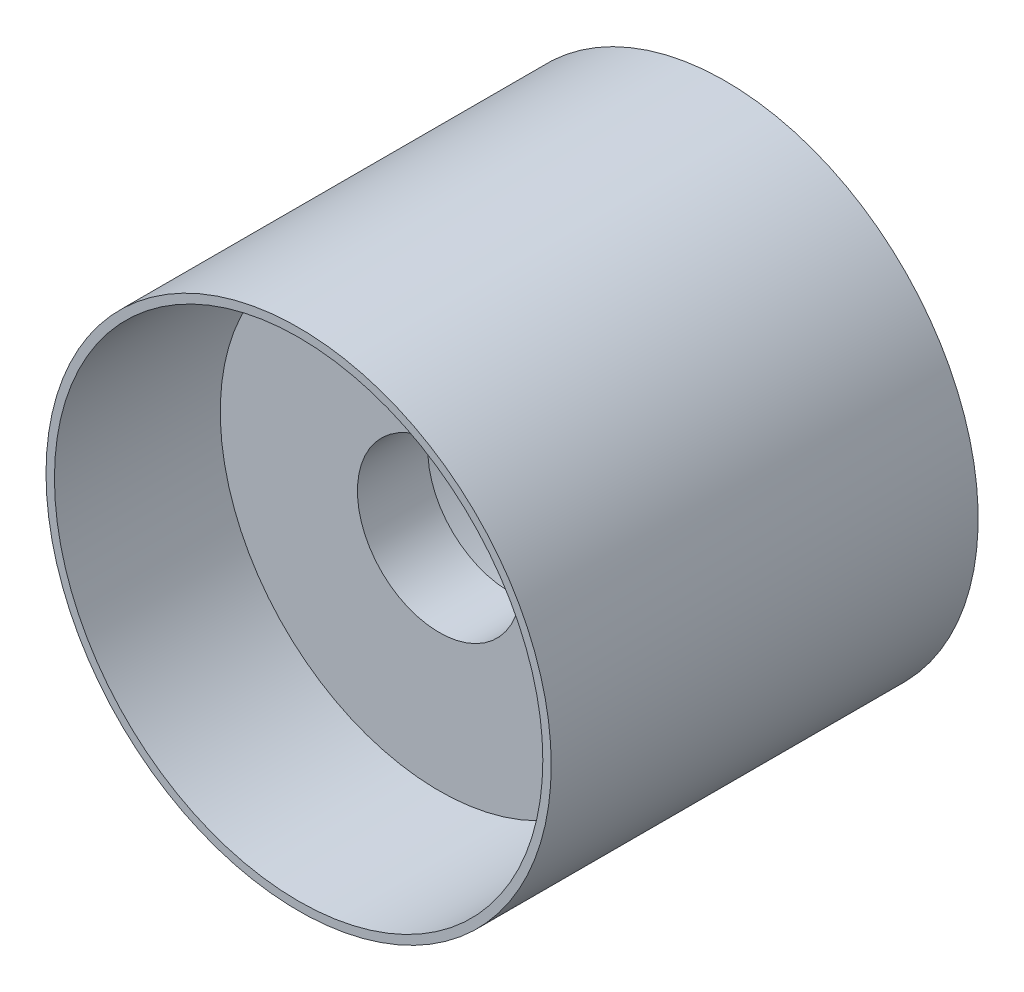
ISO-10303-21;
HEADER;
FILE_DESCRIPTION(('STEP AP214'),'2;1');
FILE_NAME('part.step','',(''),(''),'','','');
FILE_SCHEMA(('AUTOMOTIVE_DESIGN { 1 0 10303 214 1 1 1 1 }'));
ENDSEC;
DATA;
#1=APPLICATION_CONTEXT('core data for automotive mechanical design processes');
#2=APPLICATION_PROTOCOL_DEFINITION('international standard','automotive_design',2000,#1);
#3=PRODUCT_CONTEXT('',#1,'mechanical');
#4=PRODUCT('Part','Part','',(#3));
#5=PRODUCT_RELATED_PRODUCT_CATEGORY('part','',(#4));
#6=PRODUCT_DEFINITION_FORMATION('','',#4);
#7=PRODUCT_DEFINITION_CONTEXT('part definition',#1,'design');
#8=PRODUCT_DEFINITION('design','',#6,#7);
#9=PRODUCT_DEFINITION_SHAPE('','',#8);
#10=(LENGTH_UNIT() NAMED_UNIT(*) SI_UNIT(.MILLI.,.METRE.));
#11=(NAMED_UNIT(*) PLANE_ANGLE_UNIT() SI_UNIT($,.RADIAN.));
#12=(NAMED_UNIT(*) SI_UNIT($,.STERADIAN.) SOLID_ANGLE_UNIT());
#13=UNCERTAINTY_MEASURE_WITH_UNIT(LENGTH_MEASURE(1.E-05),#10,'distance_accuracy_value','');
#14=(GEOMETRIC_REPRESENTATION_CONTEXT(3) GLOBAL_UNCERTAINTY_ASSIGNED_CONTEXT((#13)) GLOBAL_UNIT_ASSIGNED_CONTEXT((#10,
#11,#12)) REPRESENTATION_CONTEXT('',''));
#15=CARTESIAN_POINT('',(0.,0.,0.));
#16=DIRECTION('',(0.,0.,1.));
#17=DIRECTION('',(1.,0.,0.));
#18=AXIS2_PLACEMENT_3D('',#15,#16,#17);
#19=CARTESIAN_POINT('',(79.0213670886076,-25.,-258.));
#20=DIRECTION('',(1.,0.,0.));
#21=DIRECTION('',(0.,0.,-1.));
#22=AXIS2_PLACEMENT_3D('',#19,#20,#21);
#23=PLANE('',#22);
#24=DIRECTION('',(0.,1.,0.));
#25=VECTOR('',#24,1.);
#26=CARTESIAN_POINT('',(79.0213670886076,25.,-330.737929633017));
#27=LINE('',#26,#25);
#28=CARTESIAN_POINT('',(79.0213670886076,-25.,-330.737929633017));
#29=VERTEX_POINT('',#28);
#30=CARTESIAN_POINT('',(79.0213670886076,25.,-330.737929633017));
#31=VERTEX_POINT('',#30);
#32=EDGE_CURVE('E215',#29,#31,#27,.T.);
#33=ORIENTED_EDGE('',*,*,#32,.F.);
#34=DIRECTION('',(0.,0.,1.));
#35=VECTOR('',#34,1.);
#36=CARTESIAN_POINT('',(79.0213670886076,-25.,-258.));
#37=LINE('',#36,#35);
#38=CARTESIAN_POINT('',(79.0213670886076,-25.,-248.));
#39=VERTEX_POINT('',#38);
#40=EDGE_CURVE('E228',#29,#39,#37,.T.);
#41=ORIENTED_EDGE('',*,*,#40,.T.);
#42=DIRECTION('',(0.,1.,0.));
#43=VECTOR('',#42,1.);
#44=CARTESIAN_POINT('',(79.0213670886076,-25.,-248.));
#45=LINE('',#44,#43);
#46=CARTESIAN_POINT('',(79.0213670886076,25.,-248.));
#47=VERTEX_POINT('',#46);
#48=EDGE_CURVE('E514',#39,#47,#45,.T.);
#49=ORIENTED_EDGE('',*,*,#48,.T.);
#50=DIRECTION('',(0.,0.,1.));
#51=VECTOR('',#50,1.);
#52=CARTESIAN_POINT('',(79.0213670886076,25.,-258.));
#53=LINE('',#52,#51);
#54=EDGE_CURVE('E230',#31,#47,#53,.T.);
#55=ORIENTED_EDGE('',*,*,#54,.F.);
#56=EDGE_LOOP('',(#33,#41,#49,#55));
#57=FACE_BOUND('',#56,.T.);
#58=ADVANCED_FACE('F49',(#57),#23,.F.);
#59=CARTESIAN_POINT('',(0.,0.,-248.));
#60=DIRECTION('',(0.,0.,-1.));
#61=DIRECTION('',(-1.,0.,0.));
#62=AXIS2_PLACEMENT_3D('',#59,#60,#61);
#63=PLANE('',#62);
#64=CARTESIAN_POINT('',(0.,0.,-248.));
#65=DIRECTION('',(0.,0.,-1.));
#66=DIRECTION('',(-1.,0.,0.));
#67=AXIS2_PLACEMENT_3D('',#64,#65,#66);
#68=CIRCLE('',#67,300.);
#69=CARTESIAN_POINT('',(-300.,0.,-248.));
#70=VERTEX_POINT('',#69);
#71=EDGE_CURVE('E243',#70,#70,#68,.T.);
#72=ORIENTED_EDGE('',*,*,#71,.T.);
#73=EDGE_LOOP('',(#72));
#74=FACE_BOUND('',#73,.T.);
#75=DIRECTION('',(-1.,0.,0.));
#76=VECTOR('',#75,1.);
#77=CARTESIAN_POINT('',(142.803790235081,-25.,-248.));
#78=LINE('',#77,#76);
#79=CARTESIAN_POINT('',(142.803790235081,-25.,-248.));
#80=VERTEX_POINT('',#79);
#81=EDGE_CURVE('E236',#80,#39,#78,.T.);
#82=ORIENTED_EDGE('',*,*,#81,.F.);
#83=DIRECTION('',(0.,-1.,0.));
#84=VECTOR('',#83,1.);
#85=CARTESIAN_POINT('',(142.803790235081,25.,-248.));
#86=LINE('',#85,#84);
#87=CARTESIAN_POINT('',(142.803790235081,25.,-248.));
#88=VERTEX_POINT('',#87);
#89=EDGE_CURVE('E508',#88,#80,#86,.T.);
#90=ORIENTED_EDGE('',*,*,#89,.F.);
#91=DIRECTION('',(1.,0.,0.));
#92=VECTOR('',#91,1.);
#93=CARTESIAN_POINT('',(79.0213670886076,25.,-248.));
#94=LINE('',#93,#92);
#95=EDGE_CURVE('E517',#47,#88,#94,.T.);
#96=ORIENTED_EDGE('',*,*,#95,.F.);
#97=ORIENTED_EDGE('',*,*,#48,.F.);
#98=EDGE_LOOP('',(#82,#90,#96,#97));
#99=FACE_BOUND('',#98,.T.);
#100=DIRECTION('',(1.,0.,0.));
#101=VECTOR('',#100,1.);
#102=CARTESIAN_POINT('',(-142.80379,25.,-248.));
#103=LINE('',#102,#101);
#104=CARTESIAN_POINT('',(-142.80379,25.,-248.));
#105=VERTEX_POINT('',#104);
#106=CARTESIAN_POINT('',(-79.02137,25.,-248.));
#107=VERTEX_POINT('',#106);
#108=EDGE_CURVE('E484',#105,#107,#103,.T.);
#109=ORIENTED_EDGE('',*,*,#108,.F.);
#110=DIRECTION('',(0.,1.,0.));
#111=VECTOR('',#110,1.);
#112=CARTESIAN_POINT('',(-142.80379,-25.,-248.));
#113=LINE('',#112,#111);
#114=CARTESIAN_POINT('',(-142.80379,-25.,-248.));
#115=VERTEX_POINT('',#114);
#116=EDGE_CURVE('E223',#115,#105,#113,.T.);
#117=ORIENTED_EDGE('',*,*,#116,.F.);
#118=DIRECTION('',(-1.,0.,0.));
#119=VECTOR('',#118,1.);
#120=CARTESIAN_POINT('',(-79.02137,-25.,-248.));
#121=LINE('',#120,#119);
#122=CARTESIAN_POINT('',(-79.02137,-25.,-248.));
#123=VERTEX_POINT('',#122);
#124=EDGE_CURVE('E492',#123,#115,#121,.T.);
#125=ORIENTED_EDGE('',*,*,#124,.F.);
#126=DIRECTION('',(0.,-1.,0.));
#127=VECTOR('',#126,1.);
#128=CARTESIAN_POINT('',(-79.02137,25.,-248.));
#129=LINE('',#128,#127);
#130=EDGE_CURVE('E488',#107,#123,#129,.T.);
#131=ORIENTED_EDGE('',*,*,#130,.F.);
#132=EDGE_LOOP('',(#109,#117,#125,#131));
#133=FACE_BOUND('',#132,.T.);
#134=ADVANCED_FACE('F531',(#74,#99,#133),#63,.T.);
#135=CARTESIAN_POINT('',(0.,0.,259.));
#136=DIRECTION('',(0.,0.,1.));
#137=DIRECTION('',(1.,0.,0.));
#138=AXIS2_PLACEMENT_3D('',#135,#136,#137);
#139=PLANE('',#138);
#140=CARTESIAN_POINT('',(0.,0.,259.));
#141=DIRECTION('',(0.,0.,1.));
#142=DIRECTION('',(1.,0.,0.));
#143=AXIS2_PLACEMENT_3D('',#140,#141,#142);
#144=CIRCLE('',#143,300.);
#145=CARTESIAN_POINT('',(300.,0.,259.));
#146=VERTEX_POINT('',#145);
#147=EDGE_CURVE('E260',#146,#146,#144,.T.);
#148=ORIENTED_EDGE('',*,*,#147,.T.);
#149=EDGE_LOOP('',(#148));
#150=FACE_BOUND('',#149,.T.);
#151=CARTESIAN_POINT('',(0.,0.,259.));
#152=DIRECTION('',(0.,0.,1.));
#153=DIRECTION('',(1.,0.,0.));
#154=AXIS2_PLACEMENT_3D('',#151,#152,#153);
#155=CIRCLE('',#154,290.);
#156=CARTESIAN_POINT('',(290.,0.,259.));
#157=VERTEX_POINT('',#156);
#158=EDGE_CURVE('E256',#157,#157,#155,.T.);
#159=ORIENTED_EDGE('',*,*,#158,.F.);
#160=EDGE_LOOP('',(#159));
#161=FACE_BOUND('',#160,.T.);
#162=ADVANCED_FACE('F534',(#150,#161),#139,.T.);
#163=CARTESIAN_POINT('',(0.,0.,259.));
#164=DIRECTION('',(0.,0.,-1.));
#165=DIRECTION('',(-1.,0.,0.));
#166=AXIS2_PLACEMENT_3D('',#163,#164,#165);
#167=CYLINDRICAL_SURFACE('',#166,300.);
#168=ORIENTED_EDGE('',*,*,#147,.F.);
#169=EDGE_LOOP('',(#168));
#170=FACE_BOUND('',#169,.T.);
#171=ORIENTED_EDGE('',*,*,#71,.F.);
#172=EDGE_LOOP('',(#171));
#173=FACE_BOUND('',#172,.T.);
#174=ADVANCED_FACE('F580',(#170,#173),#167,.T.);
#175=CARTESIAN_POINT('',(0.,0.,259.));
#176=DIRECTION('',(0.,0.,-1.));
#177=DIRECTION('',(-1.,0.,0.));
#178=AXIS2_PLACEMENT_3D('',#175,#176,#177);
#179=CYLINDRICAL_SURFACE('',#178,290.);
#180=ORIENTED_EDGE('',*,*,#158,.T.);
#181=EDGE_LOOP('',(#180));
#182=FACE_BOUND('',#181,.T.);
#183=CARTESIAN_POINT('',(0.,0.,-238.));
#184=DIRECTION('',(0.,0.,1.));
#185=DIRECTION('',(1.,0.,0.));
#186=AXIS2_PLACEMENT_3D('',#183,#184,#185);
#187=CIRCLE('',#186,290.);
#188=CARTESIAN_POINT('',(290.,0.,-238.));
#189=VERTEX_POINT('',#188);
#190=EDGE_CURVE('E252',#189,#189,#187,.T.);
#191=ORIENTED_EDGE('',*,*,#190,.F.);
#192=EDGE_LOOP('',(#191));
#193=FACE_BOUND('',#192,.T.);
#194=ADVANCED_FACE('F576',(#182,#193),#179,.F.);
#195=CARTESIAN_POINT('',(0.,0.,-238.));
#196=DIRECTION('',(0.,0.,-1.));
#197=DIRECTION('',(-1.,0.,0.));
#198=AXIS2_PLACEMENT_3D('',#195,#196,#197);
#199=PLANE('',#198);
#200=ORIENTED_EDGE('',*,*,#190,.T.);
#201=EDGE_LOOP('',(#200));
#202=FACE_BOUND('',#201,.T.);
#203=ADVANCED_FACE('F572',(#202),#199,.F.);
#204=CARTESIAN_POINT('',(142.803790235081,25.,-258.));
#205=DIRECTION('',(-1.,0.,0.));
#206=DIRECTION('',(0.,0.,1.));
#207=AXIS2_PLACEMENT_3D('',#204,#205,#206);
#208=PLANE('',#207);
#209=DIRECTION('',(0.,0.,1.));
#210=VECTOR('',#209,1.);
#211=CARTESIAN_POINT('',(142.803790235081,-25.,-258.));
#212=LINE('',#211,#210);
#213=CARTESIAN_POINT('',(142.803790235081,-25.,-253.));
#214=VERTEX_POINT('',#213);
#215=EDGE_CURVE('E239',#214,#80,#212,.T.);
#216=ORIENTED_EDGE('',*,*,#215,.F.);
#217=DIRECTION('',(0.,-1.,0.));
#218=VECTOR('',#217,1.);
#219=CARTESIAN_POINT('',(142.803790235081,25.,-253.));
#220=LINE('',#219,#218);
#221=CARTESIAN_POINT('',(142.803790235081,25.,-253.));
#222=VERTEX_POINT('',#221);
#223=EDGE_CURVE('E369',#214,#222,#220,.F.);
#224=ORIENTED_EDGE('',*,*,#223,.T.);
#225=DIRECTION('',(0.,0.,1.));
#226=VECTOR('',#225,1.);
#227=CARTESIAN_POINT('',(142.803790235081,25.,-258.));
#228=LINE('',#227,#226);
#229=EDGE_CURVE('E245',#222,#88,#228,.T.);
#230=ORIENTED_EDGE('',*,*,#229,.T.);
#231=ORIENTED_EDGE('',*,*,#89,.T.);
#232=EDGE_LOOP('',(#216,#224,#230,#231));
#233=FACE_BOUND('',#232,.T.);
#234=ADVANCED_FACE('F524',(#233),#208,.F.);
#235=CARTESIAN_POINT('',(142.803790235081,-25.,-258.));
#236=DIRECTION('',(0.,1.,0.));
#237=DIRECTION('',(0.,0.,1.));
#238=AXIS2_PLACEMENT_3D('',#235,#236,#237);
#239=PLANE('',#238);
#240=CARTESIAN_POINT('',(91.5677795462219,-25.,-263.));
#241=DIRECTION('',(0.,1.,0.));
#242=DIRECTION('',(0.,0.,1.));
#243=AXIS2_PLACEMENT_3D('',#240,#241,#242);
#244=CIRCLE('',#243,10.);
#245=CARTESIAN_POINT('',(91.5677795462219,-25.,-253.));
#246=VERTEX_POINT('',#245);
#247=CARTESIAN_POINT('',(81.5677795462219,-25.,-263.));
#248=VERTEX_POINT('',#247);
#249=EDGE_CURVE('E320',#246,#248,#244,.F.);
#250=ORIENTED_EDGE('',*,*,#249,.F.);
#251=DIRECTION('',(-1.,0.,0.));
#252=VECTOR('',#251,1.);
#253=CARTESIAN_POINT('',(142.803790235081,-25.,-253.));
#254=LINE('',#253,#252);
#255=EDGE_CURVE('E324',#246,#214,#254,.F.);
#256=ORIENTED_EDGE('',*,*,#255,.T.);
#257=ORIENTED_EDGE('',*,*,#215,.T.);
#258=ORIENTED_EDGE('',*,*,#81,.T.);
#259=ORIENTED_EDGE('',*,*,#40,.F.);
#260=DIRECTION('',(1.,0.,0.));
#261=VECTOR('',#260,1.);
#262=CARTESIAN_POINT('',(-79.0213729113924,-25.,-330.737929633017));
#263=LINE('',#262,#261);
#264=CARTESIAN_POINT('',(-74.02137,-25.,-330.737929633017));
#265=VERTEX_POINT('',#264);
#266=EDGE_CURVE('E211',#265,#29,#263,.T.);
#267=ORIENTED_EDGE('',*,*,#266,.F.);
#268=CARTESIAN_POINT('',(-74.02137,-25.,-325.737929633017));
#269=DIRECTION('',(0.,1.,0.));
#270=DIRECTION('',(0.,0.,1.));
#271=AXIS2_PLACEMENT_3D('',#268,#269,#270);
#272=CIRCLE('',#271,5.);
#273=CARTESIAN_POINT('',(-79.02137,-25.,-325.737929633017));
#274=VERTEX_POINT('',#273);
#275=EDGE_CURVE('E12',#265,#274,#272,.T.);
#276=ORIENTED_EDGE('',*,*,#275,.T.);
#277=DIRECTION('',(0.,0.,1.));
#278=VECTOR('',#277,1.);
#279=CARTESIAN_POINT('',(-79.02137,-25.,-258.));
#280=LINE('',#279,#278);
#281=EDGE_CURVE('E499',#274,#123,#280,.T.);
#282=ORIENTED_EDGE('',*,*,#281,.T.);
#283=ORIENTED_EDGE('',*,*,#124,.T.);
#284=DIRECTION('',(0.,0.,1.));
#285=VECTOR('',#284,1.);
#286=CARTESIAN_POINT('',(-142.80379,-25.,-258.));
#287=LINE('',#286,#285);
#288=CARTESIAN_POINT('',(-142.80379,-25.,-253.));
#289=VERTEX_POINT('',#288);
#290=EDGE_CURVE('E496',#289,#115,#287,.T.);
#291=ORIENTED_EDGE('',*,*,#290,.F.);
#292=DIRECTION('',(-1.,0.,0.));
#293=VECTOR('',#292,1.);
#294=CARTESIAN_POINT('',(-86.56778,-25.,-253.));
#295=LINE('',#294,#293);
#296=CARTESIAN_POINT('',(-91.56778,-25.,-253.));
#297=VERTEX_POINT('',#296);
#298=EDGE_CURVE('E317',#289,#297,#295,.F.);
#299=ORIENTED_EDGE('',*,*,#298,.T.);
#300=CARTESIAN_POINT('',(-91.56778,-25.,-263.));
#301=DIRECTION('',(0.,1.,0.));
#302=DIRECTION('',(0.,0.,1.));
#303=AXIS2_PLACEMENT_3D('',#300,#301,#302);
#304=CIRCLE('',#303,10.);
#305=CARTESIAN_POINT('',(-81.56778,-25.,-263.));
#306=VERTEX_POINT('',#305);
#307=EDGE_CURVE('E313',#306,#297,#304,.F.);
#308=ORIENTED_EDGE('',*,*,#307,.F.);
#309=DIRECTION('',(0.,0.,1.));
#310=VECTOR('',#309,1.);
#311=CARTESIAN_POINT('',(-81.56778,-25.,-258.));
#312=LINE('',#311,#310);
#313=CARTESIAN_POINT('',(-81.56778,-25.,-333.));
#314=VERTEX_POINT('',#313);
#315=EDGE_CURVE('E310',#306,#314,#312,.F.);
#316=ORIENTED_EDGE('',*,*,#315,.T.);
#317=DIRECTION('',(-1.,0.,0.));
#318=VECTOR('',#317,1.);
#319=CARTESIAN_POINT('',(142.803790235081,-25.,-333.));
#320=LINE('',#319,#318);
#321=CARTESIAN_POINT('',(81.5677795462219,-25.,-333.));
#322=VERTEX_POINT('',#321);
#323=EDGE_CURVE('E304',#314,#322,#320,.F.);
#324=ORIENTED_EDGE('',*,*,#323,.T.);
#325=DIRECTION('',(0.,0.,1.));
#326=VECTOR('',#325,1.);
#327=CARTESIAN_POINT('',(81.5677795462219,-25.,-258.));
#328=LINE('',#327,#326);
#329=EDGE_CURVE('E307',#322,#248,#328,.T.);
#330=ORIENTED_EDGE('',*,*,#329,.T.);
#331=EDGE_LOOP('',(#250,#256,#257,#258,#259,#267,#276,#282,#283,#291,#299,#308,#316,#324,#330));
#332=FACE_BOUND('',#331,.T.);
#333=ADVANCED_FACE('F234',(#332),#239,.F.);
#334=CARTESIAN_POINT('',(79.0213670886076,25.,-258.));
#335=DIRECTION('',(0.,-1.,0.));
#336=DIRECTION('',(0.,0.,-1.));
#337=AXIS2_PLACEMENT_3D('',#334,#335,#336);
#338=PLANE('',#337);
#339=CARTESIAN_POINT('',(-91.56778,25.,-263.));
#340=DIRECTION('',(0.,-1.,0.));
#341=DIRECTION('',(0.,0.,-1.));
#342=AXIS2_PLACEMENT_3D('',#339,#340,#341);
#343=CIRCLE('',#342,10.);
#344=CARTESIAN_POINT('',(-91.56778,25.,-253.));
#345=VERTEX_POINT('',#344);
#346=CARTESIAN_POINT('',(-81.56778,25.,-263.));
#347=VERTEX_POINT('',#346);
#348=EDGE_CURVE('E293',#345,#347,#343,.F.);
#349=ORIENTED_EDGE('',*,*,#348,.F.);
#350=DIRECTION('',(1.,0.,0.));
#351=VECTOR('',#350,1.);
#352=CARTESIAN_POINT('',(-142.80379,25.,-253.));
#353=LINE('',#352,#351);
#354=CARTESIAN_POINT('',(-142.80379,25.,-253.));
#355=VERTEX_POINT('',#354);
#356=EDGE_CURVE('E297',#345,#355,#353,.F.);
#357=ORIENTED_EDGE('',*,*,#356,.T.);
#358=DIRECTION('',(0.,0.,1.));
#359=VECTOR('',#358,1.);
#360=CARTESIAN_POINT('',(-142.80379,25.,-258.));
#361=LINE('',#360,#359);
#362=EDGE_CURVE('E505',#355,#105,#361,.T.);
#363=ORIENTED_EDGE('',*,*,#362,.T.);
#364=ORIENTED_EDGE('',*,*,#108,.T.);
#365=DIRECTION('',(0.,0.,1.));
#366=VECTOR('',#365,1.);
#367=CARTESIAN_POINT('',(-79.02137,25.,-258.));
#368=LINE('',#367,#366);
#369=CARTESIAN_POINT('',(-79.02137,25.,-325.737929633017));
#370=VERTEX_POINT('',#369);
#371=EDGE_CURVE('E502',#370,#107,#368,.T.);
#372=ORIENTED_EDGE('',*,*,#371,.F.);
#373=CARTESIAN_POINT('',(-74.02137,25.,-325.737929633017));
#374=DIRECTION('',(0.,-1.,0.));
#375=DIRECTION('',(0.,0.,-1.));
#376=AXIS2_PLACEMENT_3D('',#373,#374,#375);
#377=CIRCLE('',#376,5.);
#378=CARTESIAN_POINT('',(-74.02137,25.,-330.737929633017));
#379=VERTEX_POINT('',#378);
#380=EDGE_CURVE('E59',#370,#379,#377,.T.);
#381=ORIENTED_EDGE('',*,*,#380,.T.);
#382=DIRECTION('',(1.,0.,0.));
#383=VECTOR('',#382,1.);
#384=CARTESIAN_POINT('',(-79.0213729113924,25.,-330.737929633017));
#385=LINE('',#384,#383);
#386=EDGE_CURVE('E224',#379,#31,#385,.T.);
#387=ORIENTED_EDGE('',*,*,#386,.T.);
#388=ORIENTED_EDGE('',*,*,#54,.T.);
#389=ORIENTED_EDGE('',*,*,#95,.T.);
#390=ORIENTED_EDGE('',*,*,#229,.F.);
#391=DIRECTION('',(1.,0.,0.));
#392=VECTOR('',#391,1.);
#393=CARTESIAN_POINT('',(86.5677795462219,25.,-253.));
#394=LINE('',#393,#392);
#395=CARTESIAN_POINT('',(91.5677795462219,25.,-253.));
#396=VERTEX_POINT('',#395);
#397=EDGE_CURVE('E287',#222,#396,#394,.F.);
#398=ORIENTED_EDGE('',*,*,#397,.T.);
#399=CARTESIAN_POINT('',(91.5677795462219,25.,-263.));
#400=DIRECTION('',(0.,-1.,0.));
#401=DIRECTION('',(0.,0.,-1.));
#402=AXIS2_PLACEMENT_3D('',#399,#400,#401);
#403=CIRCLE('',#402,10.);
#404=CARTESIAN_POINT('',(81.5677795462219,25.,-263.));
#405=VERTEX_POINT('',#404);
#406=EDGE_CURVE('E283',#405,#396,#403,.F.);
#407=ORIENTED_EDGE('',*,*,#406,.F.);
#408=DIRECTION('',(0.,0.,1.));
#409=VECTOR('',#408,1.);
#410=CARTESIAN_POINT('',(81.5677795462219,25.,-258.));
#411=LINE('',#410,#409);
#412=CARTESIAN_POINT('',(81.5677795462219,25.,-333.));
#413=VERTEX_POINT('',#412);
#414=EDGE_CURVE('E280',#405,#413,#411,.F.);
#415=ORIENTED_EDGE('',*,*,#414,.T.);
#416=DIRECTION('',(1.,0.,0.));
#417=VECTOR('',#416,1.);
#418=CARTESIAN_POINT('',(79.0213670886076,25.,-333.));
#419=LINE('',#418,#417);
#420=CARTESIAN_POINT('',(-81.56778,25.,-333.));
#421=VERTEX_POINT('',#420);
#422=EDGE_CURVE('E277',#413,#421,#419,.F.);
#423=ORIENTED_EDGE('',*,*,#422,.T.);
#424=DIRECTION('',(0.,0.,1.));
#425=VECTOR('',#424,1.);
#426=CARTESIAN_POINT('',(-81.56778,25.,-258.));
#427=LINE('',#426,#425);
#428=EDGE_CURVE('E290',#421,#347,#427,.T.);
#429=ORIENTED_EDGE('',*,*,#428,.T.);
#430=EDGE_LOOP('',(#349,#357,#363,#364,#372,#381,#387,#388,#389,#390,#398,#407,#415,#423,#429));
#431=FACE_BOUND('',#430,.T.);
#432=ADVANCED_FACE('F529',(#431),#338,.F.);
#433=CARTESIAN_POINT('',(0.,0.,-258.));
#434=DIRECTION('',(0.,0.,-1.));
#435=DIRECTION('',(-1.,0.,0.));
#436=AXIS2_PLACEMENT_3D('',#433,#434,#435);
#437=PLANE('',#436);
#438=DIRECTION('',(0.,-1.,0.));
#439=VECTOR('',#438,1.);
#440=CARTESIAN_POINT('',(137.803790235081,-25.,-258.));
#441=LINE('',#440,#439);
#442=CARTESIAN_POINT('',(137.803790235081,20.,-258.));
#443=VERTEX_POINT('',#442);
#444=CARTESIAN_POINT('',(137.803790235081,-20.,-258.));
#445=VERTEX_POINT('',#444);
#446=EDGE_CURVE('E359',#443,#445,#441,.T.);
#447=ORIENTED_EDGE('',*,*,#446,.T.);
#448=DIRECTION('',(-1.,0.,0.));
#449=VECTOR('',#448,1.);
#450=CARTESIAN_POINT('',(86.5677795462219,-20.,-258.));
#451=LINE('',#450,#449);
#452=CARTESIAN_POINT('',(91.5677795462219,-20.,-258.));
#453=VERTEX_POINT('',#452);
#454=EDGE_CURVE('E366',#445,#453,#451,.T.);
#455=ORIENTED_EDGE('',*,*,#454,.T.);
#456=DIRECTION('',(0.,-1.,0.));
#457=VECTOR('',#456,1.);
#458=CARTESIAN_POINT('',(91.5677795462219,0.,-258.));
#459=LINE('',#458,#457);
#460=CARTESIAN_POINT('',(91.5677795462219,20.,-258.));
#461=VERTEX_POINT('',#460);
#462=EDGE_CURVE('E362',#453,#461,#459,.F.);
#463=ORIENTED_EDGE('',*,*,#462,.T.);
#464=DIRECTION('',(1.,0.,0.));
#465=VECTOR('',#464,1.);
#466=CARTESIAN_POINT('',(142.803790235081,20.,-258.));
#467=LINE('',#466,#465);
#468=EDGE_CURVE('E356',#461,#443,#467,.T.);
#469=ORIENTED_EDGE('',*,*,#468,.T.);
#470=EDGE_LOOP('',(#447,#455,#463,#469));
#471=FACE_BOUND('',#470,.T.);
#472=ADVANCED_FACE('F729',(#471),#437,.T.);
#473=CARTESIAN_POINT('',(-142.80379,-25.,-258.));
#474=DIRECTION('',(1.,0.,0.));
#475=DIRECTION('',(0.,0.,-1.));
#476=AXIS2_PLACEMENT_3D('',#473,#474,#475);
#477=PLANE('',#476);
#478=ORIENTED_EDGE('',*,*,#362,.F.);
#479=DIRECTION('',(0.,1.,0.));
#480=VECTOR('',#479,1.);
#481=CARTESIAN_POINT('',(-142.80379,-25.,-253.));
#482=LINE('',#481,#480);
#483=EDGE_CURVE('E301',#355,#289,#482,.F.);
#484=ORIENTED_EDGE('',*,*,#483,.T.);
#485=ORIENTED_EDGE('',*,*,#290,.T.);
#486=ORIENTED_EDGE('',*,*,#116,.T.);
#487=EDGE_LOOP('',(#478,#484,#485,#486));
#488=FACE_BOUND('',#487,.T.);
#489=ADVANCED_FACE('F545',(#488),#477,.F.);
#490=CARTESIAN_POINT('',(-79.02137,25.,-258.));
#491=DIRECTION('',(-1.,0.,0.));
#492=DIRECTION('',(0.,0.,1.));
#493=AXIS2_PLACEMENT_3D('',#490,#491,#492);
#494=PLANE('',#493);
#495=ORIENTED_EDGE('',*,*,#281,.F.);
#496=DIRECTION('',(0.,1.,0.));
#497=VECTOR('',#496,1.);
#498=CARTESIAN_POINT('',(-79.02137,25.,-325.737929633017));
#499=LINE('',#498,#497);
#500=EDGE_CURVE('E337',#274,#370,#499,.T.);
#501=ORIENTED_EDGE('',*,*,#500,.T.);
#502=ORIENTED_EDGE('',*,*,#371,.T.);
#503=ORIENTED_EDGE('',*,*,#130,.T.);
#504=EDGE_LOOP('',(#495,#501,#502,#503));
#505=FACE_BOUND('',#504,.T.);
#506=ADVANCED_FACE('F552',(#505),#494,.F.);
#507=CARTESIAN_POINT('',(0.,0.,-258.));
#508=DIRECTION('',(0.,0.,-1.));
#509=DIRECTION('',(-1.,0.,0.));
#510=AXIS2_PLACEMENT_3D('',#507,#508,#509);
#511=PLANE('',#510);
#512=DIRECTION('',(0.,1.,0.));
#513=VECTOR('',#512,1.);
#514=CARTESIAN_POINT('',(-137.80379,25.,-258.));
#515=LINE('',#514,#513);
#516=CARTESIAN_POINT('',(-137.80379,-20.,-258.));
#517=VERTEX_POINT('',#516);
#518=CARTESIAN_POINT('',(-137.80379,20.,-258.));
#519=VERTEX_POINT('',#518);
#520=EDGE_CURVE('E270',#517,#519,#515,.T.);
#521=ORIENTED_EDGE('',*,*,#520,.T.);
#522=DIRECTION('',(1.,0.,0.));
#523=VECTOR('',#522,1.);
#524=CARTESIAN_POINT('',(-86.56778,20.,-258.));
#525=LINE('',#524,#523);
#526=CARTESIAN_POINT('',(-91.56778,20.,-258.));
#527=VERTEX_POINT('',#526);
#528=EDGE_CURVE('E273',#519,#527,#525,.T.);
#529=ORIENTED_EDGE('',*,*,#528,.T.);
#530=DIRECTION('',(0.,1.,0.));
#531=VECTOR('',#530,1.);
#532=CARTESIAN_POINT('',(-91.56778,0.,-258.));
#533=LINE('',#532,#531);
#534=CARTESIAN_POINT('',(-91.56778,-20.,-258.));
#535=VERTEX_POINT('',#534);
#536=EDGE_CURVE('E264',#527,#535,#533,.F.);
#537=ORIENTED_EDGE('',*,*,#536,.T.);
#538=DIRECTION('',(-1.,0.,0.));
#539=VECTOR('',#538,1.);
#540=CARTESIAN_POINT('',(-142.80379,-20.,-258.));
#541=LINE('',#540,#539);
#542=EDGE_CURVE('E267',#535,#517,#541,.T.);
#543=ORIENTED_EDGE('',*,*,#542,.T.);
#544=EDGE_LOOP('',(#521,#529,#537,#543));
#545=FACE_BOUND('',#544,.T.);
#546=ADVANCED_FACE('F715',(#545),#511,.T.);
#547=CARTESIAN_POINT('',(86.5677795462219,25.,-338.));
#548=DIRECTION('',(-1.,0.,0.));
#549=DIRECTION('',(0.,0.,1.));
#550=AXIS2_PLACEMENT_3D('',#547,#548,#549);
#551=PLANE('',#550);
#552=DIRECTION('',(0.,0.,1.));
#553=VECTOR('',#552,1.);
#554=CARTESIAN_POINT('',(86.5677795462219,20.,-338.));
#555=LINE('',#554,#553);
#556=CARTESIAN_POINT('',(86.5677795462219,20.,-333.));
#557=VERTEX_POINT('',#556);
#558=CARTESIAN_POINT('',(86.5677795462219,20.,-263.));
#559=VERTEX_POINT('',#558);
#560=EDGE_CURVE('E349',#557,#559,#555,.T.);
#561=ORIENTED_EDGE('',*,*,#560,.T.);
#562=DIRECTION('',(0.,-1.,0.));
#563=VECTOR('',#562,1.);
#564=CARTESIAN_POINT('',(86.5677795462219,25.,-263.));
#565=LINE('',#564,#563);
#566=CARTESIAN_POINT('',(86.5677795462219,-20.,-263.));
#567=VERTEX_POINT('',#566);
#568=EDGE_CURVE('E352',#559,#567,#565,.T.);
#569=ORIENTED_EDGE('',*,*,#568,.T.);
#570=DIRECTION('',(0.,0.,1.));
#571=VECTOR('',#570,1.);
#572=CARTESIAN_POINT('',(86.5677795462219,-20.,-338.));
#573=LINE('',#572,#571);
#574=CARTESIAN_POINT('',(86.5677795462219,-20.,-333.));
#575=VERTEX_POINT('',#574);
#576=EDGE_CURVE('E346',#567,#575,#573,.F.);
#577=ORIENTED_EDGE('',*,*,#576,.T.);
#578=DIRECTION('',(0.,-1.,0.));
#579=VECTOR('',#578,1.);
#580=CARTESIAN_POINT('',(86.5677795462219,25.,-333.));
#581=LINE('',#580,#579);
#582=EDGE_CURVE('E343',#575,#557,#581,.F.);
#583=ORIENTED_EDGE('',*,*,#582,.T.);
#584=EDGE_LOOP('',(#561,#569,#577,#583));
#585=FACE_BOUND('',#584,.T.);
#586=ADVANCED_FACE('F712',(#585),#551,.F.);
#587=CARTESIAN_POINT('',(0.,0.,-338.));
#588=DIRECTION('',(0.,0.,1.));
#589=DIRECTION('',(1.,0.,0.));
#590=AXIS2_PLACEMENT_3D('',#587,#588,#589);
#591=PLANE('',#590);
#592=DIRECTION('',(0.,1.,0.));
#593=VECTOR('',#592,1.);
#594=CARTESIAN_POINT('',(-86.56778,25.,-338.));
#595=LINE('',#594,#593);
#596=CARTESIAN_POINT('',(-86.56778,-20.,-338.));
#597=VERTEX_POINT('',#596);
#598=CARTESIAN_POINT('',(-86.56778,20.,-338.));
#599=VERTEX_POINT('',#598);
#600=EDGE_CURVE('E232',#597,#599,#595,.T.);
#601=ORIENTED_EDGE('',*,*,#600,.T.);
#602=DIRECTION('',(1.,0.,0.));
#603=VECTOR('',#602,1.);
#604=CARTESIAN_POINT('',(0.,20.,-338.));
#605=LINE('',#604,#603);
#606=CARTESIAN_POINT('',(81.5677795462219,20.,-338.));
#607=VERTEX_POINT('',#606);
#608=EDGE_CURVE('E67',#599,#607,#605,.T.);
#609=ORIENTED_EDGE('',*,*,#608,.T.);
#610=DIRECTION('',(0.,-1.,0.));
#611=VECTOR('',#610,1.);
#612=CARTESIAN_POINT('',(81.5677795462219,0.,-338.));
#613=LINE('',#612,#611);
#614=CARTESIAN_POINT('',(81.5677795462219,-20.,-338.));
#615=VERTEX_POINT('',#614);
#616=EDGE_CURVE('E71',#607,#615,#613,.T.);
#617=ORIENTED_EDGE('',*,*,#616,.T.);
#618=DIRECTION('',(-1.,0.,0.));
#619=VECTOR('',#618,1.);
#620=CARTESIAN_POINT('',(0.,-20.,-338.));
#621=LINE('',#620,#619);
#622=EDGE_CURVE('E372',#615,#597,#621,.T.);
#623=ORIENTED_EDGE('',*,*,#622,.T.);
#624=EDGE_LOOP('',(#601,#609,#617,#623));
#625=FACE_BOUND('',#624,.T.);
#626=ADVANCED_FACE('F714',(#625),#591,.F.);
#627=CARTESIAN_POINT('',(-79.0213729113924,25.,-330.737929633017));
#628=DIRECTION('',(0.,0.,-1.));
#629=DIRECTION('',(-1.,0.,0.));
#630=AXIS2_PLACEMENT_3D('',#627,#628,#629);
#631=PLANE('',#630);
#632=ORIENTED_EDGE('',*,*,#386,.F.);
#633=DIRECTION('',(0.,1.,0.));
#634=VECTOR('',#633,1.);
#635=CARTESIAN_POINT('',(-74.02137,-25.,-330.737929633017));
#636=LINE('',#635,#634);
#637=EDGE_CURVE('E218',#379,#265,#636,.F.);
#638=ORIENTED_EDGE('',*,*,#637,.T.);
#639=ORIENTED_EDGE('',*,*,#266,.T.);
#640=ORIENTED_EDGE('',*,*,#32,.T.);
#641=EDGE_LOOP('',(#632,#638,#639,#640));
#642=FACE_BOUND('',#641,.T.);
#643=ADVANCED_FACE('F214',(#642),#631,.F.);
#644=CARTESIAN_POINT('',(-86.56778,25.,-338.));
#645=DIRECTION('',(1.,0.,0.));
#646=DIRECTION('',(0.,0.,-1.));
#647=AXIS2_PLACEMENT_3D('',#644,#645,#646);
#648=PLANE('',#647);
#649=ORIENTED_EDGE('',*,*,#600,.F.);
#650=DIRECTION('',(0.,0.,1.));
#651=VECTOR('',#650,1.);
#652=CARTESIAN_POINT('',(-86.56778,-20.,-338.));
#653=LINE('',#652,#651);
#654=CARTESIAN_POINT('',(-86.56778,-20.,-263.));
#655=VERTEX_POINT('',#654);
#656=EDGE_CURVE('E334',#597,#655,#653,.T.);
#657=ORIENTED_EDGE('',*,*,#656,.T.);
#658=DIRECTION('',(0.,1.,0.));
#659=VECTOR('',#658,1.);
#660=CARTESIAN_POINT('',(-86.56778,25.,-263.));
#661=LINE('',#660,#659);
#662=CARTESIAN_POINT('',(-86.56778,20.,-263.));
#663=VERTEX_POINT('',#662);
#664=EDGE_CURVE('E330',#655,#663,#661,.T.);
#665=ORIENTED_EDGE('',*,*,#664,.T.);
#666=DIRECTION('',(0.,0.,1.));
#667=VECTOR('',#666,1.);
#668=CARTESIAN_POINT('',(-86.56778,20.,-338.));
#669=LINE('',#668,#667);
#670=EDGE_CURVE('E327',#663,#599,#669,.F.);
#671=ORIENTED_EDGE('',*,*,#670,.T.);
#672=EDGE_LOOP('',(#649,#657,#665,#671));
#673=FACE_BOUND('',#672,.T.);
#674=ADVANCED_FACE('F662',(#673),#648,.F.);
#675=CARTESIAN_POINT('',(0.,-20.,-253.));
#676=DIRECTION('',(1.,0.,0.));
#677=DIRECTION('',(0.,0.,-1.));
#678=AXIS2_PLACEMENT_3D('',#675,#676,#677);
#679=CYLINDRICAL_SURFACE('',#678,5.);
#680=CARTESIAN_POINT('',(137.803790235081,-20.,-253.));
#681=DIRECTION('',(0.707106781186547,0.707106781186547,0.));
#682=DIRECTION('',(0.707106781186547,-0.707106781186547,0.));
#683=AXIS2_PLACEMENT_3D('',#680,#681,#682);
#684=ELLIPSE('',#683,7.07106781186547,5.);
#685=EDGE_CURVE('E463',#214,#445,#684,.T.);
#686=ORIENTED_EDGE('',*,*,#685,.F.);
#687=ORIENTED_EDGE('',*,*,#255,.F.);
#688=CARTESIAN_POINT('',(91.5677795462219,-20.,-253.));
#689=DIRECTION('',(-1.,0.,0.));
#690=DIRECTION('',(0.,0.,1.));
#691=AXIS2_PLACEMENT_3D('',#688,#689,#690);
#692=CIRCLE('',#691,5.);
#693=EDGE_CURVE('E53',#453,#246,#692,.T.);
#694=ORIENTED_EDGE('',*,*,#693,.F.);
#695=ORIENTED_EDGE('',*,*,#454,.F.);
#696=EDGE_LOOP('',(#686,#687,#694,#695));
#697=FACE_BOUND('',#696,.T.);
#698=ADVANCED_FACE('F660',(#697),#679,.T.);
#699=CARTESIAN_POINT('',(91.5677795462219,-20.,-263.));
#700=DIRECTION('',(0.,1.,0.));
#701=DIRECTION('',(0.,0.,1.));
#702=AXIS2_PLACEMENT_3D('',#699,#700,#701);
#703=TOROIDAL_SURFACE('',#702,10.,5.);
#704=ORIENTED_EDGE('',*,*,#693,.T.);
#705=ORIENTED_EDGE('',*,*,#249,.T.);
#706=CARTESIAN_POINT('',(81.5677795462219,-20.,-263.));
#707=DIRECTION('',(0.,0.,1.));
#708=DIRECTION('',(1.,0.,0.));
#709=AXIS2_PLACEMENT_3D('',#706,#707,#708);
#710=CIRCLE('',#709,5.);
#711=EDGE_CURVE('E460',#567,#248,#710,.F.);
#712=ORIENTED_EDGE('',*,*,#711,.F.);
#713=CARTESIAN_POINT('',(91.5677795462219,-20.,-263.));
#714=DIRECTION('',(0.,1.,0.));
#715=DIRECTION('',(0.,0.,1.));
#716=AXIS2_PLACEMENT_3D('',#713,#714,#715);
#717=CIRCLE('',#716,5.);
#718=EDGE_CURVE('E456',#453,#567,#717,.F.);
#719=ORIENTED_EDGE('',*,*,#718,.F.);
#720=EDGE_LOOP('',(#704,#705,#712,#719));
#721=FACE_BOUND('',#720,.T.);
#722=ADVANCED_FACE('F658',(#721),#703,.T.);
#723=CARTESIAN_POINT('',(137.803790235081,0.,-253.));
#724=DIRECTION('',(0.,1.,0.));
#725=DIRECTION('',(0.,0.,1.));
#726=AXIS2_PLACEMENT_3D('',#723,#724,#725);
#727=CYLINDRICAL_SURFACE('',#726,5.);
#728=ORIENTED_EDGE('',*,*,#685,.T.);
#729=ORIENTED_EDGE('',*,*,#446,.F.);
#730=CARTESIAN_POINT('',(137.803790235081,20.,-253.));
#731=DIRECTION('',(-0.707106781186547,0.707106781186547,0.));
#732=DIRECTION('',(-0.707106781186547,-0.707106781186547,0.));
#733=AXIS2_PLACEMENT_3D('',#730,#731,#732);
#734=ELLIPSE('',#733,7.07106781186547,5.);
#735=EDGE_CURVE('E452',#222,#443,#734,.T.);
#736=ORIENTED_EDGE('',*,*,#735,.F.);
#737=ORIENTED_EDGE('',*,*,#223,.F.);
#738=EDGE_LOOP('',(#728,#729,#736,#737));
#739=FACE_BOUND('',#738,.T.);
#740=ADVANCED_FACE('F654',(#739),#727,.T.);
#741=CARTESIAN_POINT('',(81.5677795462219,-20.,-258.));
#742=DIRECTION('',(0.,0.,1.));
#743=DIRECTION('',(1.,0.,0.));
#744=AXIS2_PLACEMENT_3D('',#741,#742,#743);
#745=CYLINDRICAL_SURFACE('',#744,5.);
#746=ORIENTED_EDGE('',*,*,#711,.T.);
#747=ORIENTED_EDGE('',*,*,#329,.F.);
#748=CARTESIAN_POINT('',(81.5677795462219,-20.,-333.));
#749=DIRECTION('',(0.,0.,-1.));
#750=DIRECTION('',(-1.,0.,0.));
#751=AXIS2_PLACEMENT_3D('',#748,#749,#750);
#752=CIRCLE('',#751,5.);
#753=EDGE_CURVE('E448',#575,#322,#752,.T.);
#754=ORIENTED_EDGE('',*,*,#753,.F.);
#755=ORIENTED_EDGE('',*,*,#576,.F.);
#756=EDGE_LOOP('',(#746,#747,#754,#755));
#757=FACE_BOUND('',#756,.T.);
#758=ADVANCED_FACE('F650',(#757),#745,.T.);
#759=CARTESIAN_POINT('',(91.5677795462219,25.,-263.));
#760=DIRECTION('',(0.,-1.,0.));
#761=DIRECTION('',(0.,0.,-1.));
#762=AXIS2_PLACEMENT_3D('',#759,#760,#761);
#763=CYLINDRICAL_SURFACE('',#762,5.);
#764=ORIENTED_EDGE('',*,*,#718,.T.);
#765=ORIENTED_EDGE('',*,*,#568,.F.);
#766=CARTESIAN_POINT('',(91.5677795462219,20.,-263.));
#767=DIRECTION('',(0.,-1.,0.));
#768=DIRECTION('',(0.,0.,-1.));
#769=AXIS2_PLACEMENT_3D('',#766,#767,#768);
#770=CIRCLE('',#769,5.);
#771=EDGE_CURVE('E444',#461,#559,#770,.T.);
#772=ORIENTED_EDGE('',*,*,#771,.F.);
#773=ORIENTED_EDGE('',*,*,#462,.F.);
#774=EDGE_LOOP('',(#764,#765,#772,#773));
#775=FACE_BOUND('',#774,.T.);
#776=ADVANCED_FACE('F646',(#775),#763,.F.);
#777=CARTESIAN_POINT('',(0.,20.,-253.));
#778=DIRECTION('',(-1.,0.,0.));
#779=DIRECTION('',(0.,0.,1.));
#780=AXIS2_PLACEMENT_3D('',#777,#778,#779);
#781=CYLINDRICAL_SURFACE('',#780,5.);
#782=ORIENTED_EDGE('',*,*,#735,.T.);
#783=ORIENTED_EDGE('',*,*,#468,.F.);
#784=CARTESIAN_POINT('',(91.5677795462219,20.,-253.));
#785=DIRECTION('',(-1.,0.,0.));
#786=DIRECTION('',(0.,0.,1.));
#787=AXIS2_PLACEMENT_3D('',#784,#785,#786);
#788=CIRCLE('',#787,5.);
#789=EDGE_CURVE('E441',#396,#461,#788,.T.);
#790=ORIENTED_EDGE('',*,*,#789,.F.);
#791=ORIENTED_EDGE('',*,*,#397,.F.);
#792=EDGE_LOOP('',(#782,#783,#790,#791));
#793=FACE_BOUND('',#792,.T.);
#794=ADVANCED_FACE('F642',(#793),#781,.T.);
#795=CARTESIAN_POINT('',(81.5677795462219,-20.,-333.));
#796=DIRECTION('',(0.,0.,1.));
#797=DIRECTION('',(1.,0.,0.));
#798=AXIS2_PLACEMENT_3D('',#795,#796,#797);
#799=SPHERICAL_SURFACE('',#798,5.);
#800=CARTESIAN_POINT('',(81.5677795462219,-20.,-333.));
#801=DIRECTION('',(0.,-1.,0.));
#802=DIRECTION('',(0.,0.,-1.));
#803=AXIS2_PLACEMENT_3D('',#800,#801,#802);
#804=CIRCLE('',#803,5.);
#805=EDGE_CURVE('E434',#575,#615,#804,.F.);
#806=ORIENTED_EDGE('',*,*,#805,.F.);
#807=ORIENTED_EDGE('',*,*,#753,.T.);
#808=CARTESIAN_POINT('',(81.5677795462219,-20.,-333.));
#809=DIRECTION('',(1.,0.,0.));
#810=DIRECTION('',(0.,0.,-1.));
#811=AXIS2_PLACEMENT_3D('',#808,#809,#810);
#812=CIRCLE('',#811,5.);
#813=EDGE_CURVE('E437',#615,#322,#812,.F.);
#814=ORIENTED_EDGE('',*,*,#813,.F.);
#815=EDGE_LOOP('',(#806,#807,#814));
#816=FACE_BOUND('',#815,.T.);
#817=ADVANCED_FACE('F638',(#816),#799,.T.);
#818=CARTESIAN_POINT('',(91.5677795462219,20.,-263.));
#819=DIRECTION('',(0.,-1.,0.));
#820=DIRECTION('',(0.,0.,-1.));
#821=AXIS2_PLACEMENT_3D('',#818,#819,#820);
#822=TOROIDAL_SURFACE('',#821,10.,5.);
#823=ORIENTED_EDGE('',*,*,#789,.T.);
#824=ORIENTED_EDGE('',*,*,#771,.T.);
#825=CARTESIAN_POINT('',(81.5677795462219,20.,-263.));
#826=DIRECTION('',(0.,0.,1.));
#827=DIRECTION('',(1.,0.,0.));
#828=AXIS2_PLACEMENT_3D('',#825,#826,#827);
#829=CIRCLE('',#828,5.);
#830=EDGE_CURVE('E430',#405,#559,#829,.F.);
#831=ORIENTED_EDGE('',*,*,#830,.F.);
#832=ORIENTED_EDGE('',*,*,#406,.T.);
#833=EDGE_LOOP('',(#823,#824,#831,#832));
#834=FACE_BOUND('',#833,.T.);
#835=ADVANCED_FACE('F634',(#834),#822,.T.);
#836=CARTESIAN_POINT('',(0.,-20.,-333.));
#837=DIRECTION('',(-1.,0.,0.));
#838=DIRECTION('',(0.,0.,1.));
#839=AXIS2_PLACEMENT_3D('',#836,#837,#838);
#840=CYLINDRICAL_SURFACE('',#839,5.);
#841=ORIENTED_EDGE('',*,*,#813,.T.);
#842=ORIENTED_EDGE('',*,*,#323,.F.);
#843=CARTESIAN_POINT('',(-81.56778,-20.,-333.));
#844=DIRECTION('',(-0.707106781186547,0.,0.707106781186547));
#845=DIRECTION('',(-0.707106781186547,0.,-0.707106781186547));
#846=AXIS2_PLACEMENT_3D('',#843,#844,#845);
#847=ELLIPSE('',#846,7.07106781186547,5.);
#848=EDGE_CURVE('E426',#597,#314,#847,.T.);
#849=ORIENTED_EDGE('',*,*,#848,.F.);
#850=ORIENTED_EDGE('',*,*,#622,.F.);
#851=EDGE_LOOP('',(#841,#842,#849,#850));
#852=FACE_BOUND('',#851,.T.);
#853=ADVANCED_FACE('F630',(#852),#840,.T.);
#854=CARTESIAN_POINT('',(81.5677795462219,0.,-333.));
#855=DIRECTION('',(0.,-1.,0.));
#856=DIRECTION('',(0.,0.,-1.));
#857=AXIS2_PLACEMENT_3D('',#854,#855,#856);
#858=CYLINDRICAL_SURFACE('',#857,5.);
#859=ORIENTED_EDGE('',*,*,#805,.T.);
#860=ORIENTED_EDGE('',*,*,#616,.F.);
#861=CARTESIAN_POINT('',(81.5677795462219,20.,-333.));
#862=DIRECTION('',(0.,1.,0.));
#863=DIRECTION('',(0.,0.,1.));
#864=AXIS2_PLACEMENT_3D('',#861,#862,#863);
#865=CIRCLE('',#864,5.);
#866=EDGE_CURVE('E422',#557,#607,#865,.T.);
#867=ORIENTED_EDGE('',*,*,#866,.F.);
#868=ORIENTED_EDGE('',*,*,#582,.F.);
#869=EDGE_LOOP('',(#859,#860,#867,#868));
#870=FACE_BOUND('',#869,.T.);
#871=ADVANCED_FACE('F626',(#870),#858,.T.);
#872=CARTESIAN_POINT('',(81.5677795462219,20.,-338.));
#873=DIRECTION('',(0.,0.,1.));
#874=DIRECTION('',(1.,0.,0.));
#875=AXIS2_PLACEMENT_3D('',#872,#873,#874);
#876=CYLINDRICAL_SURFACE('',#875,5.);
#877=ORIENTED_EDGE('',*,*,#830,.T.);
#878=ORIENTED_EDGE('',*,*,#560,.F.);
#879=CARTESIAN_POINT('',(81.5677795462219,20.,-333.));
#880=DIRECTION('',(0.,0.,-1.));
#881=DIRECTION('',(-1.,0.,0.));
#882=AXIS2_PLACEMENT_3D('',#879,#880,#881);
#883=CIRCLE('',#882,5.);
#884=EDGE_CURVE('E418',#413,#557,#883,.T.);
#885=ORIENTED_EDGE('',*,*,#884,.F.);
#886=ORIENTED_EDGE('',*,*,#414,.F.);
#887=EDGE_LOOP('',(#877,#878,#885,#886));
#888=FACE_BOUND('',#887,.T.);
#889=ADVANCED_FACE('F622',(#888),#876,.T.);
#890=CARTESIAN_POINT('',(-81.56778,-20.,-338.));
#891=DIRECTION('',(0.,0.,1.));
#892=DIRECTION('',(1.,0.,0.));
#893=AXIS2_PLACEMENT_3D('',#890,#891,#892);
#894=CYLINDRICAL_SURFACE('',#893,5.);
#895=ORIENTED_EDGE('',*,*,#848,.T.);
#896=ORIENTED_EDGE('',*,*,#315,.F.);
#897=CARTESIAN_POINT('',(-81.56778,-20.,-263.));
#898=DIRECTION('',(0.,0.,1.));
#899=DIRECTION('',(1.,0.,0.));
#900=AXIS2_PLACEMENT_3D('',#897,#898,#899);
#901=CIRCLE('',#900,5.);
#902=EDGE_CURVE('E414',#655,#306,#901,.T.);
#903=ORIENTED_EDGE('',*,*,#902,.F.);
#904=ORIENTED_EDGE('',*,*,#656,.F.);
#905=EDGE_LOOP('',(#895,#896,#903,#904));
#906=FACE_BOUND('',#905,.T.);
#907=ADVANCED_FACE('F618',(#906),#894,.T.);
#908=CARTESIAN_POINT('',(81.5677795462219,20.,-333.));
#909=DIRECTION('',(0.,0.,1.));
#910=DIRECTION('',(1.,0.,0.));
#911=AXIS2_PLACEMENT_3D('',#908,#909,#910);
#912=SPHERICAL_SURFACE('',#911,5.);
#913=ORIENTED_EDGE('',*,*,#884,.T.);
#914=ORIENTED_EDGE('',*,*,#866,.T.);
#915=CARTESIAN_POINT('',(81.5677795462219,20.,-333.));
#916=DIRECTION('',(1.,0.,0.));
#917=DIRECTION('',(0.,0.,-1.));
#918=AXIS2_PLACEMENT_3D('',#915,#916,#917);
#919=CIRCLE('',#918,5.);
#920=EDGE_CURVE('E410',#413,#607,#919,.F.);
#921=ORIENTED_EDGE('',*,*,#920,.F.);
#922=EDGE_LOOP('',(#913,#914,#921));
#923=FACE_BOUND('',#922,.T.);
#924=ADVANCED_FACE('F614',(#923),#912,.T.);
#925=CARTESIAN_POINT('',(-91.56778,-20.,-263.));
#926=DIRECTION('',(0.,1.,0.));
#927=DIRECTION('',(0.,0.,1.));
#928=AXIS2_PLACEMENT_3D('',#925,#926,#927);
#929=TOROIDAL_SURFACE('',#928,10.,5.);
#930=ORIENTED_EDGE('',*,*,#902,.T.);
#931=ORIENTED_EDGE('',*,*,#307,.T.);
#932=CARTESIAN_POINT('',(-91.56778,-20.,-253.));
#933=DIRECTION('',(1.,0.,0.));
#934=DIRECTION('',(0.,0.,-1.));
#935=AXIS2_PLACEMENT_3D('',#932,#933,#934);
#936=CIRCLE('',#935,5.);
#937=EDGE_CURVE('E406',#535,#297,#936,.F.);
#938=ORIENTED_EDGE('',*,*,#937,.F.);
#939=CARTESIAN_POINT('',(-91.56778,-20.,-263.));
#940=DIRECTION('',(0.,1.,0.));
#941=DIRECTION('',(0.,0.,1.));
#942=AXIS2_PLACEMENT_3D('',#939,#940,#941);
#943=CIRCLE('',#942,5.);
#944=EDGE_CURVE('E402',#655,#535,#943,.F.);
#945=ORIENTED_EDGE('',*,*,#944,.F.);
#946=EDGE_LOOP('',(#930,#931,#938,#945));
#947=FACE_BOUND('',#946,.T.);
#948=ADVANCED_FACE('F610',(#947),#929,.T.);
#949=CARTESIAN_POINT('',(0.,20.,-333.));
#950=DIRECTION('',(1.,0.,0.));
#951=DIRECTION('',(0.,0.,-1.));
#952=AXIS2_PLACEMENT_3D('',#949,#950,#951);
#953=CYLINDRICAL_SURFACE('',#952,5.);
#954=ORIENTED_EDGE('',*,*,#920,.T.);
#955=ORIENTED_EDGE('',*,*,#608,.F.);
#956=CARTESIAN_POINT('',(-81.56778,20.,-333.));
#957=DIRECTION('',(0.707106781186547,0.,-0.707106781186547));
#958=DIRECTION('',(0.707106781186547,0.,0.707106781186547));
#959=AXIS2_PLACEMENT_3D('',#956,#957,#958);
#960=ELLIPSE('',#959,7.07106781186547,5.);
#961=EDGE_CURVE('E398',#421,#599,#960,.F.);
#962=ORIENTED_EDGE('',*,*,#961,.F.);
#963=ORIENTED_EDGE('',*,*,#422,.F.);
#964=EDGE_LOOP('',(#954,#955,#962,#963));
#965=FACE_BOUND('',#964,.T.);
#966=ADVANCED_FACE('F606',(#965),#953,.T.);
#967=CARTESIAN_POINT('',(0.,-20.,-253.));
#968=DIRECTION('',(1.,0.,0.));
#969=DIRECTION('',(0.,0.,-1.));
#970=AXIS2_PLACEMENT_3D('',#967,#968,#969);
#971=CYLINDRICAL_SURFACE('',#970,5.);
#972=ORIENTED_EDGE('',*,*,#937,.T.);
#973=ORIENTED_EDGE('',*,*,#298,.F.);
#974=CARTESIAN_POINT('',(-137.80379,-20.,-253.));
#975=DIRECTION('',(0.707106781186547,-0.707106781186547,0.));
#976=DIRECTION('',(0.707106781186547,0.707106781186547,0.));
#977=AXIS2_PLACEMENT_3D('',#974,#975,#976);
#978=ELLIPSE('',#977,7.07106781186547,5.);
#979=EDGE_CURVE('E394',#517,#289,#978,.F.);
#980=ORIENTED_EDGE('',*,*,#979,.F.);
#981=ORIENTED_EDGE('',*,*,#542,.F.);
#982=EDGE_LOOP('',(#972,#973,#980,#981));
#983=FACE_BOUND('',#982,.T.);
#984=ADVANCED_FACE('F602',(#983),#971,.T.);
#985=CARTESIAN_POINT('',(-91.56778,25.,-263.));
#986=DIRECTION('',(0.,1.,0.));
#987=DIRECTION('',(0.,0.,1.));
#988=AXIS2_PLACEMENT_3D('',#985,#986,#987);
#989=CYLINDRICAL_SURFACE('',#988,5.);
#990=ORIENTED_EDGE('',*,*,#944,.T.);
#991=ORIENTED_EDGE('',*,*,#536,.F.);
#992=CARTESIAN_POINT('',(-91.56778,20.,-263.));
#993=DIRECTION('',(0.,-1.,0.));
#994=DIRECTION('',(0.,0.,-1.));
#995=AXIS2_PLACEMENT_3D('',#992,#993,#994);
#996=CIRCLE('',#995,5.);
#997=EDGE_CURVE('E390',#663,#527,#996,.T.);
#998=ORIENTED_EDGE('',*,*,#997,.F.);
#999=ORIENTED_EDGE('',*,*,#664,.F.);
#1000=EDGE_LOOP('',(#990,#991,#998,#999));
#1001=FACE_BOUND('',#1000,.T.);
#1002=ADVANCED_FACE('F598',(#1001),#989,.F.);
#1003=CARTESIAN_POINT('',(-81.56778,20.,-258.));
#1004=DIRECTION('',(0.,0.,1.));
#1005=DIRECTION('',(1.,0.,0.));
#1006=AXIS2_PLACEMENT_3D('',#1003,#1004,#1005);
#1007=CYLINDRICAL_SURFACE('',#1006,5.);
#1008=ORIENTED_EDGE('',*,*,#961,.T.);
#1009=ORIENTED_EDGE('',*,*,#670,.F.);
#1010=CARTESIAN_POINT('',(-81.56778,20.,-263.));
#1011=DIRECTION('',(0.,0.,1.));
#1012=DIRECTION('',(1.,0.,0.));
#1013=AXIS2_PLACEMENT_3D('',#1010,#1011,#1012);
#1014=CIRCLE('',#1013,5.);
#1015=EDGE_CURVE('E387',#347,#663,#1014,.T.);
#1016=ORIENTED_EDGE('',*,*,#1015,.F.);
#1017=ORIENTED_EDGE('',*,*,#428,.F.);
#1018=EDGE_LOOP('',(#1008,#1009,#1016,#1017));
#1019=FACE_BOUND('',#1018,.T.);
#1020=ADVANCED_FACE('F594',(#1019),#1007,.T.);
#1021=CARTESIAN_POINT('',(-137.80379,0.,-253.));
#1022=DIRECTION('',(0.,-1.,0.));
#1023=DIRECTION('',(0.,0.,-1.));
#1024=AXIS2_PLACEMENT_3D('',#1021,#1022,#1023);
#1025=CYLINDRICAL_SURFACE('',#1024,5.);
#1026=ORIENTED_EDGE('',*,*,#979,.T.);
#1027=ORIENTED_EDGE('',*,*,#483,.F.);
#1028=CARTESIAN_POINT('',(-137.80379,20.,-253.));
#1029=DIRECTION('',(-0.707106781186547,-0.707106781186547,0.));
#1030=DIRECTION('',(0.707106781186547,-0.707106781186547,0.));
#1031=AXIS2_PLACEMENT_3D('',#1028,#1029,#1030);
#1032=ELLIPSE('',#1031,7.07106781186547,5.);
#1033=EDGE_CURVE('E384',#519,#355,#1032,.F.);
#1034=ORIENTED_EDGE('',*,*,#1033,.F.);
#1035=ORIENTED_EDGE('',*,*,#520,.F.);
#1036=EDGE_LOOP('',(#1026,#1027,#1034,#1035));
#1037=FACE_BOUND('',#1036,.T.);
#1038=ADVANCED_FACE('F590',(#1037),#1025,.T.);
#1039=CARTESIAN_POINT('',(-91.56778,20.,-263.));
#1040=DIRECTION('',(0.,-1.,0.));
#1041=DIRECTION('',(0.,0.,-1.));
#1042=AXIS2_PLACEMENT_3D('',#1039,#1040,#1041);
#1043=TOROIDAL_SURFACE('',#1042,10.,5.);
#1044=ORIENTED_EDGE('',*,*,#1015,.T.);
#1045=ORIENTED_EDGE('',*,*,#997,.T.);
#1046=CARTESIAN_POINT('',(-91.56778,20.,-253.));
#1047=DIRECTION('',(1.,0.,0.));
#1048=DIRECTION('',(0.,0.,-1.));
#1049=AXIS2_PLACEMENT_3D('',#1046,#1047,#1048);
#1050=CIRCLE('',#1049,5.);
#1051=EDGE_CURVE('E381',#345,#527,#1050,.F.);
#1052=ORIENTED_EDGE('',*,*,#1051,.F.);
#1053=ORIENTED_EDGE('',*,*,#348,.T.);
#1054=EDGE_LOOP('',(#1044,#1045,#1052,#1053));
#1055=FACE_BOUND('',#1054,.T.);
#1056=ADVANCED_FACE('F559',(#1055),#1043,.T.);
#1057=CARTESIAN_POINT('',(0.,20.,-253.));
#1058=DIRECTION('',(-1.,0.,0.));
#1059=DIRECTION('',(0.,0.,1.));
#1060=AXIS2_PLACEMENT_3D('',#1057,#1058,#1059);
#1061=CYLINDRICAL_SURFACE('',#1060,5.);
#1062=ORIENTED_EDGE('',*,*,#1033,.T.);
#1063=ORIENTED_EDGE('',*,*,#356,.F.);
#1064=ORIENTED_EDGE('',*,*,#1051,.T.);
#1065=ORIENTED_EDGE('',*,*,#528,.F.);
#1066=EDGE_LOOP('',(#1062,#1063,#1064,#1065));
#1067=FACE_BOUND('',#1066,.T.);
#1068=ADVANCED_FACE('F555',(#1067),#1061,.T.);
#1069=CARTESIAN_POINT('',(-74.02137,25.,-325.737929633017));
#1070=DIRECTION('',(0.,-1.,0.));
#1071=DIRECTION('',(0.,0.,-1.));
#1072=AXIS2_PLACEMENT_3D('',#1069,#1070,#1071);
#1073=CYLINDRICAL_SURFACE('',#1072,5.);
#1074=ORIENTED_EDGE('',*,*,#275,.F.);
#1075=ORIENTED_EDGE('',*,*,#637,.F.);
#1076=ORIENTED_EDGE('',*,*,#380,.F.);
#1077=ORIENTED_EDGE('',*,*,#500,.F.);
#1078=EDGE_LOOP('',(#1074,#1075,#1076,#1077));
#1079=FACE_BOUND('',#1078,.T.);
#1080=ADVANCED_FACE('F51',(#1079),#1073,.F.);
#1081=CLOSED_SHELL('',(#58,#134,#162,#174,#194,#203,#234,#333,#432,#472,#489,#506,#546,#586,
#626,#643,#674,#698,#722,#740,#758,#776,#794,#817,#835,#853,#871,#889,#907,#924,#948,#966,#984,
#1002,#1020,#1038,#1056,#1068,#1080));
#1082=MANIFOLD_SOLID_BREP('B2',#1081);
#1083=CARTESIAN_POINT('',(260.,0.,92.0640569395017));
#1084=DIRECTION('',(0.,0.,1.));
#1085=DIRECTION('',(1.,0.,0.));
#1086=AXIS2_PLACEMENT_3D('',#1083,#1084,#1085);
#1087=PLANE('',#1086);
#1088=CARTESIAN_POINT('',(0.,0.,92.0640569395017));
#1089=DIRECTION('',(0.,0.,1.));
#1090=DIRECTION('',(1.,0.,0.));
#1091=AXIS2_PLACEMENT_3D('',#1088,#1089,#1090);
#1092=CIRCLE('',#1091,97.102355);
#1093=CARTESIAN_POINT('',(97.102355,0.,92.0640569395017));
#1094=VERTEX_POINT('',#1093);
#1095=EDGE_CURVE('E1016',#1094,#1094,#1092,.T.);
#1096=ORIENTED_EDGE('',*,*,#1095,.F.);
#1097=EDGE_LOOP('',(#1096));
#1098=FACE_BOUND('',#1097,.T.);
#1099=CARTESIAN_POINT('',(0.,0.,92.0640569395017));
#1100=DIRECTION('',(0.,0.,1.));
#1101=DIRECTION('',(1.,0.,0.));
#1102=AXIS2_PLACEMENT_3D('',#1099,#1100,#1101);
#1103=CIRCLE('',#1102,260.);
#1104=CARTESIAN_POINT('',(260.,0.,92.0640569395017));
#1105=VERTEX_POINT('',#1104);
#1106=EDGE_CURVE('E48',#1105,#1105,#1103,.T.);
#1107=ORIENTED_EDGE('',*,*,#1106,.T.);
#1108=EDGE_LOOP('',(#1107));
#1109=FACE_BOUND('',#1108,.T.);
#1110=ADVANCED_FACE('F1009',(#1098,#1109),#1087,.T.);
#1111=CARTESIAN_POINT('',(0.,0.,92.0640569395017));
#1112=DIRECTION('',(0.,0.,1.));
#1113=DIRECTION('',(1.,0.,0.));
#1114=AXIS2_PLACEMENT_3D('',#1111,#1112,#1113);
#1115=CONICAL_SURFACE('',#1114,260.,1.09638507369664);
#1116=CARTESIAN_POINT('',(0.,0.,8.41157428573384));
#1117=DIRECTION('',(0.,0.,1.));
#1118=DIRECTION('',(1.,0.,0.));
#1119=AXIS2_PLACEMENT_3D('',#1116,#1117,#1118);
#1120=CIRCLE('',#1119,97.102355);
#1121=CARTESIAN_POINT('',(97.102355,0.,8.41157428573384));
#1122=VERTEX_POINT('',#1121);
#1123=EDGE_CURVE('E1012',#1122,#1122,#1120,.F.);
#1124=ORIENTED_EDGE('',*,*,#1123,.F.);
#1125=EDGE_LOOP('',(#1124));
#1126=FACE_BOUND('',#1125,.T.);
#1127=ORIENTED_EDGE('',*,*,#1106,.F.);
#1128=EDGE_LOOP('',(#1127));
#1129=FACE_BOUND('',#1128,.T.);
#1130=ADVANCED_FACE('F1028',(#1126,#1129),#1115,.T.);
#1131=CARTESIAN_POINT('',(0.,0.,-76.));
#1132=DIRECTION('',(0.,0.,1.));
#1133=DIRECTION('',(1.,0.,0.));
#1134=AXIS2_PLACEMENT_3D('',#1131,#1132,#1133);
#1135=CYLINDRICAL_SURFACE('',#1134,97.102355);
#1136=ORIENTED_EDGE('',*,*,#1095,.T.);
#1137=EDGE_LOOP('',(#1136));
#1138=FACE_BOUND('',#1137,.T.);
#1139=ORIENTED_EDGE('',*,*,#1123,.T.);
#1140=EDGE_LOOP('',(#1139));
#1141=FACE_BOUND('',#1140,.T.);
#1142=ADVANCED_FACE('F1026',(#1138,#1141),#1135,.F.);
#1143=CLOSED_SHELL('',(#1110,#1130,#1142));
#1144=MANIFOLD_SOLID_BREP('B6',#1143);
#1145=ADVANCED_BREP_SHAPE_REPRESENTATION('',(#18,#1082,#1144),#14);
#1146=SHAPE_DEFINITION_REPRESENTATION(#9,#1145);
ENDSEC;
END-ISO-10303-21;
